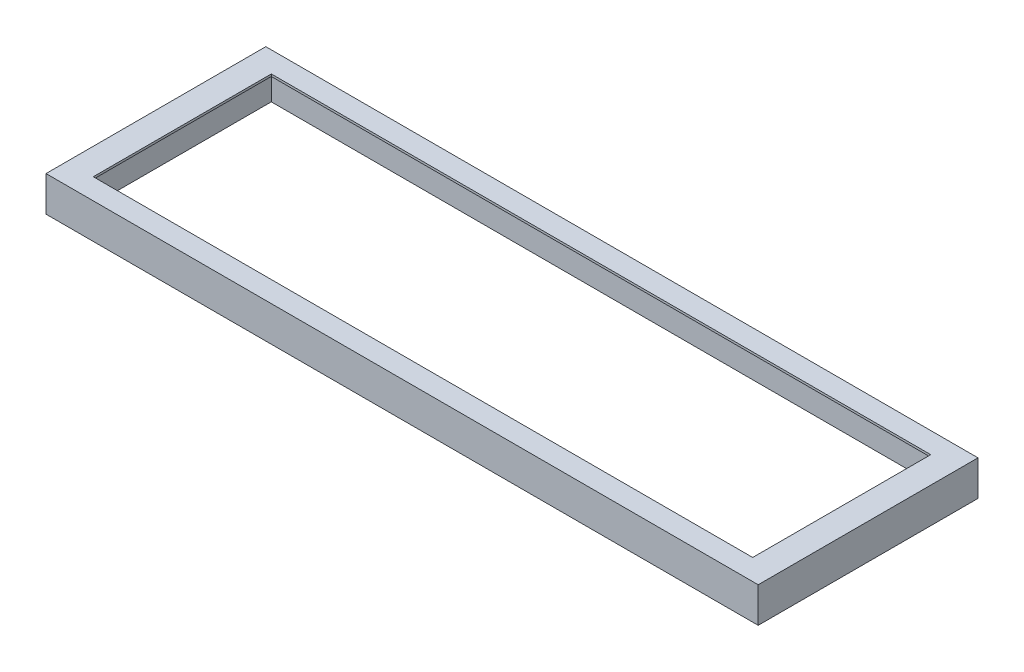
ISO-10303-21;
HEADER;
FILE_DESCRIPTION(('STEP AP214'),'2;1');
FILE_NAME('part.step','',(''),(''),'','','');
FILE_SCHEMA(('AUTOMOTIVE_DESIGN { 1 0 10303 214 1 1 1 1 }'));
ENDSEC;
DATA;
#1=APPLICATION_CONTEXT('core data for automotive mechanical design processes');
#2=APPLICATION_PROTOCOL_DEFINITION('international standard','automotive_design',2000,#1);
#3=PRODUCT_CONTEXT('',#1,'mechanical');
#4=PRODUCT('Part','Part','',(#3));
#5=PRODUCT_RELATED_PRODUCT_CATEGORY('part','',(#4));
#6=PRODUCT_DEFINITION_FORMATION('','',#4);
#7=PRODUCT_DEFINITION_CONTEXT('part definition',#1,'design');
#8=PRODUCT_DEFINITION('design','',#6,#7);
#9=PRODUCT_DEFINITION_SHAPE('','',#8);
#10=(LENGTH_UNIT() NAMED_UNIT(*) SI_UNIT(.MILLI.,.METRE.));
#11=(NAMED_UNIT(*) PLANE_ANGLE_UNIT() SI_UNIT($,.RADIAN.));
#12=(NAMED_UNIT(*) SI_UNIT($,.STERADIAN.) SOLID_ANGLE_UNIT());
#13=UNCERTAINTY_MEASURE_WITH_UNIT(LENGTH_MEASURE(1.E-05),#10,'distance_accuracy_value','');
#14=(GEOMETRIC_REPRESENTATION_CONTEXT(3) GLOBAL_UNCERTAINTY_ASSIGNED_CONTEXT((#13)) GLOBAL_UNIT_ASSIGNED_CONTEXT((#10,
#11,#12)) REPRESENTATION_CONTEXT('',''));
#15=CARTESIAN_POINT('',(0.,0.,0.));
#16=DIRECTION('',(0.,0.,1.));
#17=DIRECTION('',(1.,0.,0.));
#18=AXIS2_PLACEMENT_3D('',#15,#16,#17);
#19=CARTESIAN_POINT('',(0.,50.8,0.));
#20=DIRECTION('',(0.,1.,0.));
#21=DIRECTION('',(0.,0.,1.));
#22=AXIS2_PLACEMENT_3D('',#19,#20,#21);
#23=PLANE('',#22);
#24=DIRECTION('',(0.,0.,1.));
#25=VECTOR('',#24,1.);
#26=CARTESIAN_POINT('',(-476.25,50.8,-128.5875));
#27=LINE('',#26,#25);
#28=CARTESIAN_POINT('',(-476.25,50.8,-128.5875));
#29=VERTEX_POINT('',#28);
#30=CARTESIAN_POINT('',(-476.25,50.8,128.5875));
#31=VERTEX_POINT('',#30);
#32=EDGE_CURVE('E53',#29,#31,#27,.T.);
#33=ORIENTED_EDGE('',*,*,#32,.F.);
#34=DIRECTION('',(-1.,0.,0.));
#35=VECTOR('',#34,1.);
#36=CARTESIAN_POINT('',(476.25,50.8,-128.5875));
#37=LINE('',#36,#35);
#38=CARTESIAN_POINT('',(476.25,50.8,-128.5875));
#39=VERTEX_POINT('',#38);
#40=EDGE_CURVE('E144',#39,#29,#37,.T.);
#41=ORIENTED_EDGE('',*,*,#40,.F.);
#42=DIRECTION('',(0.,0.,-1.));
#43=VECTOR('',#42,1.);
#44=CARTESIAN_POINT('',(476.25,50.8,-128.5875));
#45=LINE('',#44,#43);
#46=CARTESIAN_POINT('',(476.25,50.8,128.5875));
#47=VERTEX_POINT('',#46);
#48=EDGE_CURVE('E129',#47,#39,#45,.T.);
#49=ORIENTED_EDGE('',*,*,#48,.F.);
#50=DIRECTION('',(1.,0.,0.));
#51=VECTOR('',#50,1.);
#52=CARTESIAN_POINT('',(476.25,50.8,128.5875));
#53=LINE('',#52,#51);
#54=EDGE_CURVE('E138',#31,#47,#53,.T.);
#55=ORIENTED_EDGE('',*,*,#54,.F.);
#56=EDGE_LOOP('',(#33,#41,#49,#55));
#57=FACE_BOUND('',#56,.T.);
#58=DIRECTION('',(1.,0.,0.));
#59=VECTOR('',#58,1.);
#60=CARTESIAN_POINT('',(0.,50.8,158.75));
#61=LINE('',#60,#59);
#62=CARTESIAN_POINT('',(-514.35,50.8,158.75));
#63=VERTEX_POINT('',#62);
#64=CARTESIAN_POINT('',(514.35,50.8,158.75));
#65=VERTEX_POINT('',#64);
#66=EDGE_CURVE('E184',#63,#65,#61,.T.);
#67=ORIENTED_EDGE('',*,*,#66,.T.);
#68=DIRECTION('',(0.,0.,-1.));
#69=VECTOR('',#68,1.);
#70=CARTESIAN_POINT('',(514.35,50.8,0.));
#71=LINE('',#70,#69);
#72=CARTESIAN_POINT('',(514.35,50.8,-158.75));
#73=VERTEX_POINT('',#72);
#74=EDGE_CURVE('E187',#65,#73,#71,.T.);
#75=ORIENTED_EDGE('',*,*,#74,.T.);
#76=DIRECTION('',(1.,0.,0.));
#77=VECTOR('',#76,1.);
#78=CARTESIAN_POINT('',(0.,50.8,-158.75));
#79=LINE('',#78,#77);
#80=CARTESIAN_POINT('',(-514.35,50.8,-158.75));
#81=VERTEX_POINT('',#80);
#82=EDGE_CURVE('E190',#81,#73,#79,.T.);
#83=ORIENTED_EDGE('',*,*,#82,.F.);
#84=DIRECTION('',(0.,0.,-1.));
#85=VECTOR('',#84,1.);
#86=CARTESIAN_POINT('',(-514.35,50.8,0.));
#87=LINE('',#86,#85);
#88=EDGE_CURVE('E193',#63,#81,#87,.T.);
#89=ORIENTED_EDGE('',*,*,#88,.F.);
#90=EDGE_LOOP('',(#67,#75,#83,#89));
#91=FACE_BOUND('',#90,.T.);
#92=ADVANCED_FACE('F38',(#57,#91),#23,.T.);
#93=CARTESIAN_POINT('',(0.,47.625,0.));
#94=DIRECTION('',(0.,-1.,0.));
#95=DIRECTION('',(0.,0.,-1.));
#96=AXIS2_PLACEMENT_3D('',#93,#94,#95);
#97=PLANE('',#96);
#98=DIRECTION('',(0.,0.,-1.));
#99=VECTOR('',#98,1.);
#100=CARTESIAN_POINT('',(-476.25,47.625,0.));
#101=LINE('',#100,#99);
#102=CARTESIAN_POINT('',(-476.25,47.625,128.5875));
#103=VERTEX_POINT('',#102);
#104=CARTESIAN_POINT('',(-476.25,47.625,-128.5875));
#105=VERTEX_POINT('',#104);
#106=EDGE_CURVE('E11',#103,#105,#101,.T.);
#107=ORIENTED_EDGE('',*,*,#106,.F.);
#108=DIRECTION('',(-1.,0.,0.));
#109=VECTOR('',#108,1.);
#110=CARTESIAN_POINT('',(0.,47.625,128.5875));
#111=LINE('',#110,#109);
#112=CARTESIAN_POINT('',(476.25,47.625,128.5875));
#113=VERTEX_POINT('',#112);
#114=EDGE_CURVE('E215',#113,#103,#111,.T.);
#115=ORIENTED_EDGE('',*,*,#114,.F.);
#116=DIRECTION('',(0.,0.,1.));
#117=VECTOR('',#116,1.);
#118=CARTESIAN_POINT('',(476.25,47.625,0.));
#119=LINE('',#118,#117);
#120=CARTESIAN_POINT('',(476.25,47.625,-128.5875));
#121=VERTEX_POINT('',#120);
#122=EDGE_CURVE('E132',#121,#113,#119,.T.);
#123=ORIENTED_EDGE('',*,*,#122,.F.);
#124=DIRECTION('',(1.,0.,0.));
#125=VECTOR('',#124,1.);
#126=CARTESIAN_POINT('',(0.,47.625,-128.5875));
#127=LINE('',#126,#125);
#128=EDGE_CURVE('E46',#105,#121,#127,.T.);
#129=ORIENTED_EDGE('',*,*,#128,.F.);
#130=EDGE_LOOP('',(#107,#115,#123,#129));
#131=FACE_BOUND('',#130,.T.);
#132=DIRECTION('',(1.,0.,0.));
#133=VECTOR('',#132,1.);
#134=CARTESIAN_POINT('',(0.,47.625,-144.4625));
#135=LINE('',#134,#133);
#136=CARTESIAN_POINT('',(-492.125,47.625,-144.4625));
#137=VERTEX_POINT('',#136);
#138=CARTESIAN_POINT('',(492.125,47.625,-144.4625));
#139=VERTEX_POINT('',#138);
#140=EDGE_CURVE('E154',#137,#139,#135,.T.);
#141=ORIENTED_EDGE('',*,*,#140,.T.);
#142=DIRECTION('',(0.,0.,1.));
#143=VECTOR('',#142,1.);
#144=CARTESIAN_POINT('',(492.125,47.625,0.));
#145=LINE('',#144,#143);
#146=CARTESIAN_POINT('',(492.125,47.625,144.4625));
#147=VERTEX_POINT('',#146);
#148=EDGE_CURVE('E157',#139,#147,#145,.T.);
#149=ORIENTED_EDGE('',*,*,#148,.T.);
#150=DIRECTION('',(1.,0.,0.));
#151=VECTOR('',#150,1.);
#152=CARTESIAN_POINT('',(0.,47.625,144.4625));
#153=LINE('',#152,#151);
#154=CARTESIAN_POINT('',(-492.125,47.625,144.4625));
#155=VERTEX_POINT('',#154);
#156=EDGE_CURVE('E161',#155,#147,#153,.T.);
#157=ORIENTED_EDGE('',*,*,#156,.F.);
#158=DIRECTION('',(0.,0.,1.));
#159=VECTOR('',#158,1.);
#160=CARTESIAN_POINT('',(-492.125,47.625,0.));
#161=LINE('',#160,#159);
#162=EDGE_CURVE('E163',#137,#155,#161,.T.);
#163=ORIENTED_EDGE('',*,*,#162,.F.);
#164=EDGE_LOOP('',(#141,#149,#157,#163));
#165=FACE_BOUND('',#164,.T.);
#166=ADVANCED_FACE('F223',(#131,#165),#97,.T.);
#167=CARTESIAN_POINT('',(0.,50.8,158.75));
#168=DIRECTION('',(0.,0.,-1.));
#169=DIRECTION('',(-1.,0.,0.));
#170=AXIS2_PLACEMENT_3D('',#167,#168,#169);
#171=PLANE('',#170);
#172=DIRECTION('',(1.,0.,0.));
#173=VECTOR('',#172,1.);
#174=CARTESIAN_POINT('',(0.,0.,158.75));
#175=LINE('',#174,#173);
#176=CARTESIAN_POINT('',(-514.35,0.,158.75));
#177=VERTEX_POINT('',#176);
#178=CARTESIAN_POINT('',(514.35,0.,158.75));
#179=VERTEX_POINT('',#178);
#180=EDGE_CURVE('E177',#177,#179,#175,.T.);
#181=ORIENTED_EDGE('',*,*,#180,.T.);
#182=DIRECTION('',(0.,-1.,0.));
#183=VECTOR('',#182,1.);
#184=CARTESIAN_POINT('',(514.35,50.8,158.75));
#185=LINE('',#184,#183);
#186=EDGE_CURVE('E212',#65,#179,#185,.T.);
#187=ORIENTED_EDGE('',*,*,#186,.F.);
#188=ORIENTED_EDGE('',*,*,#66,.F.);
#189=DIRECTION('',(0.,-1.,0.));
#190=VECTOR('',#189,1.);
#191=CARTESIAN_POINT('',(-514.35,50.8,158.75));
#192=LINE('',#191,#190);
#193=EDGE_CURVE('E196',#63,#177,#192,.T.);
#194=ORIENTED_EDGE('',*,*,#193,.T.);
#195=EDGE_LOOP('',(#181,#187,#188,#194));
#196=FACE_BOUND('',#195,.T.);
#197=ADVANCED_FACE('F40',(#196),#171,.F.);
#198=CARTESIAN_POINT('',(514.35,50.8,0.));
#199=DIRECTION('',(-1.,0.,0.));
#200=DIRECTION('',(0.,0.,1.));
#201=AXIS2_PLACEMENT_3D('',#198,#199,#200);
#202=PLANE('',#201);
#203=DIRECTION('',(0.,0.,-1.));
#204=VECTOR('',#203,1.);
#205=CARTESIAN_POINT('',(514.35,0.,0.));
#206=LINE('',#205,#204);
#207=CARTESIAN_POINT('',(514.35,0.,-158.75));
#208=VERTEX_POINT('',#207);
#209=EDGE_CURVE('E199',#179,#208,#206,.T.);
#210=ORIENTED_EDGE('',*,*,#209,.T.);
#211=DIRECTION('',(0.,-1.,0.));
#212=VECTOR('',#211,1.);
#213=CARTESIAN_POINT('',(514.35,50.8,-158.75));
#214=LINE('',#213,#212);
#215=EDGE_CURVE('E210',#73,#208,#214,.T.);
#216=ORIENTED_EDGE('',*,*,#215,.F.);
#217=ORIENTED_EDGE('',*,*,#74,.F.);
#218=ORIENTED_EDGE('',*,*,#186,.T.);
#219=EDGE_LOOP('',(#210,#216,#217,#218));
#220=FACE_BOUND('',#219,.T.);
#221=ADVANCED_FACE('F257',(#220),#202,.F.);
#222=CARTESIAN_POINT('',(0.,50.8,-158.75));
#223=DIRECTION('',(0.,0.,-1.));
#224=DIRECTION('',(-1.,0.,0.));
#225=AXIS2_PLACEMENT_3D('',#222,#223,#224);
#226=PLANE('',#225);
#227=DIRECTION('',(1.,0.,0.));
#228=VECTOR('',#227,1.);
#229=CARTESIAN_POINT('',(0.,0.,-158.75));
#230=LINE('',#229,#228);
#231=CARTESIAN_POINT('',(-514.35,0.,-158.75));
#232=VERTEX_POINT('',#231);
#233=EDGE_CURVE('E202',#232,#208,#230,.T.);
#234=ORIENTED_EDGE('',*,*,#233,.F.);
#235=DIRECTION('',(0.,-1.,0.));
#236=VECTOR('',#235,1.);
#237=CARTESIAN_POINT('',(-514.35,50.8,-158.75));
#238=LINE('',#237,#236);
#239=EDGE_CURVE('E208',#81,#232,#238,.T.);
#240=ORIENTED_EDGE('',*,*,#239,.F.);
#241=ORIENTED_EDGE('',*,*,#82,.T.);
#242=ORIENTED_EDGE('',*,*,#215,.T.);
#243=EDGE_LOOP('',(#234,#240,#241,#242));
#244=FACE_BOUND('',#243,.T.);
#245=ADVANCED_FACE('F254',(#244),#226,.T.);
#246=CARTESIAN_POINT('',(-514.35,50.8,0.));
#247=DIRECTION('',(-1.,0.,0.));
#248=DIRECTION('',(0.,0.,1.));
#249=AXIS2_PLACEMENT_3D('',#246,#247,#248);
#250=PLANE('',#249);
#251=DIRECTION('',(0.,0.,-1.));
#252=VECTOR('',#251,1.);
#253=CARTESIAN_POINT('',(-514.35,0.,0.));
#254=LINE('',#253,#252);
#255=EDGE_CURVE('E188',#177,#232,#254,.T.);
#256=ORIENTED_EDGE('',*,*,#255,.F.);
#257=ORIENTED_EDGE('',*,*,#193,.F.);
#258=ORIENTED_EDGE('',*,*,#88,.T.);
#259=ORIENTED_EDGE('',*,*,#239,.T.);
#260=EDGE_LOOP('',(#256,#257,#258,#259));
#261=FACE_BOUND('',#260,.T.);
#262=ADVANCED_FACE('F250',(#261),#250,.T.);
#263=CARTESIAN_POINT('',(0.,0.,0.));
#264=DIRECTION('',(0.,1.,0.));
#265=DIRECTION('',(0.,0.,1.));
#266=AXIS2_PLACEMENT_3D('',#263,#264,#265);
#267=PLANE('',#266);
#268=DIRECTION('',(0.,0.,1.));
#269=VECTOR('',#268,1.);
#270=CARTESIAN_POINT('',(492.125,0.,0.));
#271=LINE('',#270,#269);
#272=CARTESIAN_POINT('',(492.125,0.,-144.4625));
#273=VERTEX_POINT('',#272);
#274=CARTESIAN_POINT('',(492.125,0.,144.4625));
#275=VERTEX_POINT('',#274);
#276=EDGE_CURVE('E167',#273,#275,#271,.T.);
#277=ORIENTED_EDGE('',*,*,#276,.F.);
#278=DIRECTION('',(1.,0.,0.));
#279=VECTOR('',#278,1.);
#280=CARTESIAN_POINT('',(0.,0.,-144.4625));
#281=LINE('',#280,#279);
#282=CARTESIAN_POINT('',(-492.125,0.,-144.4625));
#283=VERTEX_POINT('',#282);
#284=EDGE_CURVE('E151',#283,#273,#281,.T.);
#285=ORIENTED_EDGE('',*,*,#284,.F.);
#286=DIRECTION('',(0.,0.,1.));
#287=VECTOR('',#286,1.);
#288=CARTESIAN_POINT('',(-492.125,0.,0.));
#289=LINE('',#288,#287);
#290=CARTESIAN_POINT('',(-492.125,0.,144.4625));
#291=VERTEX_POINT('',#290);
#292=EDGE_CURVE('E158',#283,#291,#289,.T.);
#293=ORIENTED_EDGE('',*,*,#292,.T.);
#294=DIRECTION('',(1.,0.,0.));
#295=VECTOR('',#294,1.);
#296=CARTESIAN_POINT('',(0.,0.,144.4625));
#297=LINE('',#296,#295);
#298=EDGE_CURVE('E170',#291,#275,#297,.T.);
#299=ORIENTED_EDGE('',*,*,#298,.T.);
#300=EDGE_LOOP('',(#277,#285,#293,#299));
#301=FACE_BOUND('',#300,.T.);
#302=ORIENTED_EDGE('',*,*,#180,.F.);
#303=ORIENTED_EDGE('',*,*,#255,.T.);
#304=ORIENTED_EDGE('',*,*,#233,.T.);
#305=ORIENTED_EDGE('',*,*,#209,.F.);
#306=EDGE_LOOP('',(#302,#303,#304,#305));
#307=FACE_BOUND('',#306,.T.);
#308=ADVANCED_FACE('F247',(#301,#307),#267,.F.);
#309=CARTESIAN_POINT('',(0.,47.625,-144.4625));
#310=DIRECTION('',(0.,0.,-1.));
#311=DIRECTION('',(-1.,0.,0.));
#312=AXIS2_PLACEMENT_3D('',#309,#310,#311);
#313=PLANE('',#312);
#314=ORIENTED_EDGE('',*,*,#284,.T.);
#315=DIRECTION('',(0.,-1.,0.));
#316=VECTOR('',#315,1.);
#317=CARTESIAN_POINT('',(492.125,47.625,-144.4625));
#318=LINE('',#317,#316);
#319=EDGE_CURVE('E165',#139,#273,#318,.T.);
#320=ORIENTED_EDGE('',*,*,#319,.F.);
#321=ORIENTED_EDGE('',*,*,#140,.F.);
#322=DIRECTION('',(0.,-1.,0.));
#323=VECTOR('',#322,1.);
#324=CARTESIAN_POINT('',(-492.125,47.625,-144.4625));
#325=LINE('',#324,#323);
#326=EDGE_CURVE('E175',#137,#283,#325,.T.);
#327=ORIENTED_EDGE('',*,*,#326,.T.);
#328=EDGE_LOOP('',(#314,#320,#321,#327));
#329=FACE_BOUND('',#328,.T.);
#330=ADVANCED_FACE('F246',(#329),#313,.F.);
#331=CARTESIAN_POINT('',(-492.125,47.625,0.));
#332=DIRECTION('',(1.,0.,0.));
#333=DIRECTION('',(0.,0.,-1.));
#334=AXIS2_PLACEMENT_3D('',#331,#332,#333);
#335=PLANE('',#334);
#336=ORIENTED_EDGE('',*,*,#292,.F.);
#337=ORIENTED_EDGE('',*,*,#326,.F.);
#338=ORIENTED_EDGE('',*,*,#162,.T.);
#339=DIRECTION('',(0.,-1.,0.));
#340=VECTOR('',#339,1.);
#341=CARTESIAN_POINT('',(-492.125,47.625,144.4625));
#342=LINE('',#341,#340);
#343=EDGE_CURVE('E178',#155,#291,#342,.T.);
#344=ORIENTED_EDGE('',*,*,#343,.T.);
#345=EDGE_LOOP('',(#336,#337,#338,#344));
#346=FACE_BOUND('',#345,.T.);
#347=ADVANCED_FACE('F324',(#346),#335,.T.);
#348=CARTESIAN_POINT('',(0.,47.625,144.4625));
#349=DIRECTION('',(0.,0.,-1.));
#350=DIRECTION('',(-1.,0.,0.));
#351=AXIS2_PLACEMENT_3D('',#348,#349,#350);
#352=PLANE('',#351);
#353=ORIENTED_EDGE('',*,*,#298,.F.);
#354=ORIENTED_EDGE('',*,*,#343,.F.);
#355=ORIENTED_EDGE('',*,*,#156,.T.);
#356=DIRECTION('',(0.,-1.,0.));
#357=VECTOR('',#356,1.);
#358=CARTESIAN_POINT('',(492.125,47.625,144.4625));
#359=LINE('',#358,#357);
#360=EDGE_CURVE('E180',#147,#275,#359,.T.);
#361=ORIENTED_EDGE('',*,*,#360,.T.);
#362=EDGE_LOOP('',(#353,#354,#355,#361));
#363=FACE_BOUND('',#362,.T.);
#364=ADVANCED_FACE('F234',(#363),#352,.T.);
#365=CARTESIAN_POINT('',(492.125,47.625,0.));
#366=DIRECTION('',(1.,0.,0.));
#367=DIRECTION('',(0.,0.,-1.));
#368=AXIS2_PLACEMENT_3D('',#365,#366,#367);
#369=PLANE('',#368);
#370=ORIENTED_EDGE('',*,*,#276,.T.);
#371=ORIENTED_EDGE('',*,*,#360,.F.);
#372=ORIENTED_EDGE('',*,*,#148,.F.);
#373=ORIENTED_EDGE('',*,*,#319,.T.);
#374=EDGE_LOOP('',(#370,#371,#372,#373));
#375=FACE_BOUND('',#374,.T.);
#376=ADVANCED_FACE('F227',(#375),#369,.F.);
#377=CARTESIAN_POINT('',(-476.25,0.,-128.5875));
#378=DIRECTION('',(-1.,0.,0.));
#379=DIRECTION('',(0.,0.,1.));
#380=AXIS2_PLACEMENT_3D('',#377,#378,#379);
#381=PLANE('',#380);
#382=ORIENTED_EDGE('',*,*,#106,.T.);
#383=DIRECTION('',(0.,1.,0.));
#384=VECTOR('',#383,1.);
#385=CARTESIAN_POINT('',(-476.25,0.,-128.5875));
#386=LINE('',#385,#384);
#387=EDGE_CURVE('E149',#105,#29,#386,.T.);
#388=ORIENTED_EDGE('',*,*,#387,.T.);
#389=ORIENTED_EDGE('',*,*,#32,.T.);
#390=DIRECTION('',(0.,1.,0.));
#391=VECTOR('',#390,1.);
#392=CARTESIAN_POINT('',(-476.25,0.,128.5875));
#393=LINE('',#392,#391);
#394=EDGE_CURVE('E135',#103,#31,#393,.T.);
#395=ORIENTED_EDGE('',*,*,#394,.F.);
#396=EDGE_LOOP('',(#382,#388,#389,#395));
#397=FACE_BOUND('',#396,.T.);
#398=ADVANCED_FACE('F225',(#397),#381,.F.);
#399=CARTESIAN_POINT('',(476.25,0.,-128.5875));
#400=DIRECTION('',(0.,0.,-1.));
#401=DIRECTION('',(-1.,0.,0.));
#402=AXIS2_PLACEMENT_3D('',#399,#400,#401);
#403=PLANE('',#402);
#404=ORIENTED_EDGE('',*,*,#128,.T.);
#405=DIRECTION('',(0.,1.,0.));
#406=VECTOR('',#405,1.);
#407=CARTESIAN_POINT('',(476.25,0.,-128.5875));
#408=LINE('',#407,#406);
#409=EDGE_CURVE('E134',#121,#39,#408,.T.);
#410=ORIENTED_EDGE('',*,*,#409,.T.);
#411=ORIENTED_EDGE('',*,*,#40,.T.);
#412=ORIENTED_EDGE('',*,*,#387,.F.);
#413=EDGE_LOOP('',(#404,#410,#411,#412));
#414=FACE_BOUND('',#413,.T.);
#415=ADVANCED_FACE('F220',(#414),#403,.F.);
#416=CARTESIAN_POINT('',(476.25,0.,-128.5875));
#417=DIRECTION('',(1.,0.,0.));
#418=DIRECTION('',(0.,0.,-1.));
#419=AXIS2_PLACEMENT_3D('',#416,#417,#418);
#420=PLANE('',#419);
#421=ORIENTED_EDGE('',*,*,#122,.T.);
#422=DIRECTION('',(0.,1.,0.));
#423=VECTOR('',#422,1.);
#424=CARTESIAN_POINT('',(476.25,0.,128.5875));
#425=LINE('',#424,#423);
#426=EDGE_CURVE('E61',#113,#47,#425,.T.);
#427=ORIENTED_EDGE('',*,*,#426,.T.);
#428=ORIENTED_EDGE('',*,*,#48,.T.);
#429=ORIENTED_EDGE('',*,*,#409,.F.);
#430=EDGE_LOOP('',(#421,#427,#428,#429));
#431=FACE_BOUND('',#430,.T.);
#432=ADVANCED_FACE('F126',(#431),#420,.F.);
#433=CARTESIAN_POINT('',(476.25,0.,128.5875));
#434=DIRECTION('',(0.,0.,1.));
#435=DIRECTION('',(1.,0.,0.));
#436=AXIS2_PLACEMENT_3D('',#433,#434,#435);
#437=PLANE('',#436);
#438=ORIENTED_EDGE('',*,*,#114,.T.);
#439=ORIENTED_EDGE('',*,*,#394,.T.);
#440=ORIENTED_EDGE('',*,*,#54,.T.);
#441=ORIENTED_EDGE('',*,*,#426,.F.);
#442=EDGE_LOOP('',(#438,#439,#440,#441));
#443=FACE_BOUND('',#442,.T.);
#444=ADVANCED_FACE('F139',(#443),#437,.F.);
#445=CLOSED_SHELL('',(#92,#166,#197,#221,#245,#262,#308,#330,#347,#364,#376,#398,#415,#432,#444));
#446=MANIFOLD_SOLID_BREP('B2',#445);
#447=ADVANCED_BREP_SHAPE_REPRESENTATION('',(#18,#446),#14);
#448=SHAPE_DEFINITION_REPRESENTATION(#9,#447);
ENDSEC;
END-ISO-10303-21;
